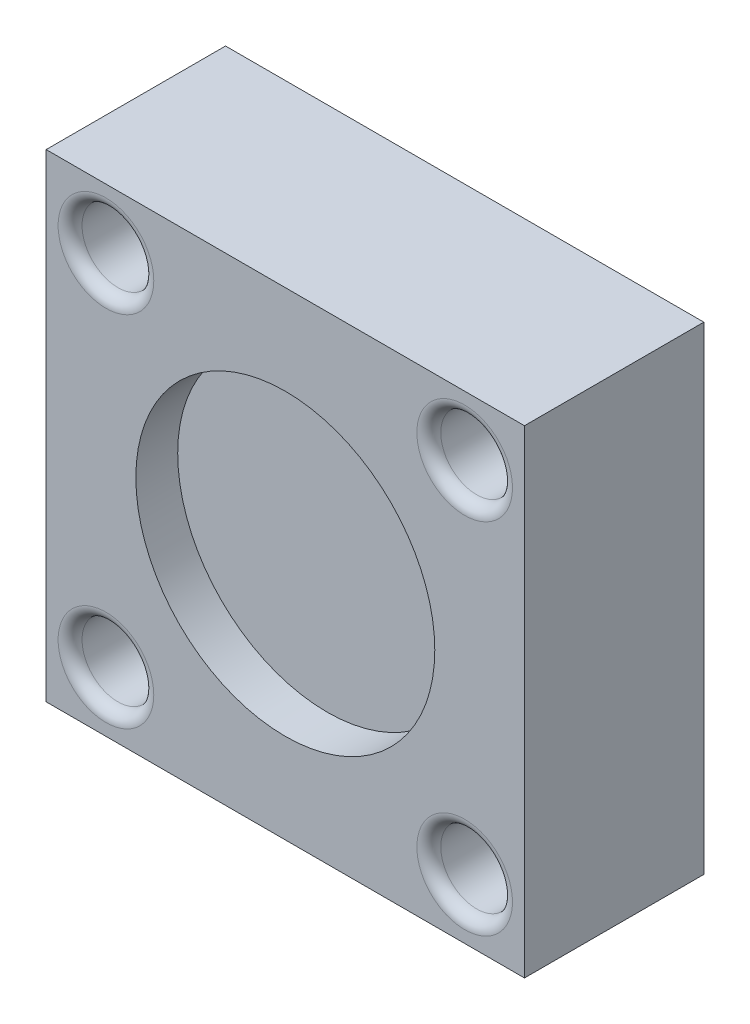
ISO-10303-21;
HEADER;
FILE_DESCRIPTION(('STEP AP214'),'2;1');
FILE_NAME('part.step','',(''),(''),'','','');
FILE_SCHEMA(('AUTOMOTIVE_DESIGN { 1 0 10303 214 1 1 1 1 }'));
ENDSEC;
DATA;
#1=APPLICATION_CONTEXT('core data for automotive mechanical design processes');
#2=APPLICATION_PROTOCOL_DEFINITION('international standard','automotive_design',2000,#1);
#3=PRODUCT_CONTEXT('',#1,'mechanical');
#4=PRODUCT('Part','Part','',(#3));
#5=PRODUCT_RELATED_PRODUCT_CATEGORY('part','',(#4));
#6=PRODUCT_DEFINITION_FORMATION('','',#4);
#7=PRODUCT_DEFINITION_CONTEXT('part definition',#1,'design');
#8=PRODUCT_DEFINITION('design','',#6,#7);
#9=PRODUCT_DEFINITION_SHAPE('','',#8);
#10=(LENGTH_UNIT() NAMED_UNIT(*) SI_UNIT(.MILLI.,.METRE.));
#11=(NAMED_UNIT(*) PLANE_ANGLE_UNIT() SI_UNIT($,.RADIAN.));
#12=(NAMED_UNIT(*) SI_UNIT($,.STERADIAN.) SOLID_ANGLE_UNIT());
#13=UNCERTAINTY_MEASURE_WITH_UNIT(LENGTH_MEASURE(1.E-05),#10,'distance_accuracy_value','');
#14=(GEOMETRIC_REPRESENTATION_CONTEXT(3) GLOBAL_UNCERTAINTY_ASSIGNED_CONTEXT((#13)) GLOBAL_UNIT_ASSIGNED_CONTEXT((#10,
#11,#12)) REPRESENTATION_CONTEXT('',''));
#15=CARTESIAN_POINT('',(0.,0.,0.));
#16=DIRECTION('',(0.,0.,1.));
#17=DIRECTION('',(1.,0.,0.));
#18=AXIS2_PLACEMENT_3D('',#15,#16,#17);
#19=CARTESIAN_POINT('',(-15.,15.,0.));
#20=DIRECTION('',(0.,0.,1.));
#21=DIRECTION('',(1.,0.,0.));
#22=AXIS2_PLACEMENT_3D('',#19,#20,#21);
#23=CYLINDRICAL_SURFACE('',#22,1.75);
#24=CARTESIAN_POINT('',(-15.,15.,0.));
#25=DIRECTION('',(0.,0.,1.));
#26=DIRECTION('',(1.,0.,0.));
#27=AXIS2_PLACEMENT_3D('',#24,#25,#26);
#28=CIRCLE('',#27,1.75);
#29=CARTESIAN_POINT('',(-13.25,15.,0.));
#30=VERTEX_POINT('',#29);
#31=EDGE_CURVE('E236',#30,#30,#28,.T.);
#32=ORIENTED_EDGE('',*,*,#31,.F.);
#33=EDGE_LOOP('',(#32));
#34=FACE_BOUND('',#33,.T.);
#35=CARTESIAN_POINT('',(-15.,15.,8.));
#36=DIRECTION('',(0.,0.,1.));
#37=DIRECTION('',(1.,0.,0.));
#38=AXIS2_PLACEMENT_3D('',#35,#36,#37);
#39=CIRCLE('',#38,1.75);
#40=CARTESIAN_POINT('',(-13.25,15.,8.));
#41=VERTEX_POINT('',#40);
#42=EDGE_CURVE('E125',#41,#41,#39,.F.);
#43=ORIENTED_EDGE('',*,*,#42,.F.);
#44=EDGE_LOOP('',(#43));
#45=FACE_BOUND('',#44,.T.);
#46=ADVANCED_FACE('F33',(#34,#45),#23,.F.);
#47=CARTESIAN_POINT('',(-15.,-15.,0.));
#48=DIRECTION('',(0.,0.,1.));
#49=DIRECTION('',(1.,0.,0.));
#50=AXIS2_PLACEMENT_3D('',#47,#48,#49);
#51=CYLINDRICAL_SURFACE('',#50,1.75);
#52=CARTESIAN_POINT('',(-15.,-15.,0.));
#53=DIRECTION('',(0.,0.,1.));
#54=DIRECTION('',(1.,0.,0.));
#55=AXIS2_PLACEMENT_3D('',#52,#53,#54);
#56=CIRCLE('',#55,1.75);
#57=CARTESIAN_POINT('',(-13.25,-15.,0.));
#58=VERTEX_POINT('',#57);
#59=EDGE_CURVE('E115',#58,#58,#56,.T.);
#60=ORIENTED_EDGE('',*,*,#59,.F.);
#61=EDGE_LOOP('',(#60));
#62=FACE_BOUND('',#61,.T.);
#63=CARTESIAN_POINT('',(-15.,-15.,8.));
#64=DIRECTION('',(0.,0.,1.));
#65=DIRECTION('',(1.,0.,0.));
#66=AXIS2_PLACEMENT_3D('',#63,#64,#65);
#67=CIRCLE('',#66,1.75);
#68=CARTESIAN_POINT('',(-13.25,-15.,8.));
#69=VERTEX_POINT('',#68);
#70=EDGE_CURVE('E121',#69,#69,#67,.F.);
#71=ORIENTED_EDGE('',*,*,#70,.F.);
#72=EDGE_LOOP('',(#71));
#73=FACE_BOUND('',#72,.T.);
#74=ADVANCED_FACE('F166',(#62,#73),#51,.F.);
#75=CARTESIAN_POINT('',(15.,-15.,0.));
#76=DIRECTION('',(0.,0.,1.));
#77=DIRECTION('',(1.,0.,0.));
#78=AXIS2_PLACEMENT_3D('',#75,#76,#77);
#79=CYLINDRICAL_SURFACE('',#78,1.75);
#80=CARTESIAN_POINT('',(15.,-15.,0.));
#81=DIRECTION('',(0.,0.,1.));
#82=DIRECTION('',(1.,0.,0.));
#83=AXIS2_PLACEMENT_3D('',#80,#81,#82);
#84=CIRCLE('',#83,1.75);
#85=CARTESIAN_POINT('',(16.75,-15.,0.));
#86=VERTEX_POINT('',#85);
#87=EDGE_CURVE('E239',#86,#86,#84,.T.);
#88=ORIENTED_EDGE('',*,*,#87,.F.);
#89=EDGE_LOOP('',(#88));
#90=FACE_BOUND('',#89,.T.);
#91=CARTESIAN_POINT('',(15.,-15.,8.));
#92=DIRECTION('',(0.,0.,1.));
#93=DIRECTION('',(1.,0.,0.));
#94=AXIS2_PLACEMENT_3D('',#91,#92,#93);
#95=CIRCLE('',#94,1.75);
#96=CARTESIAN_POINT('',(16.75,-15.,8.));
#97=VERTEX_POINT('',#96);
#98=EDGE_CURVE('E117',#97,#97,#95,.F.);
#99=ORIENTED_EDGE('',*,*,#98,.F.);
#100=EDGE_LOOP('',(#99));
#101=FACE_BOUND('',#100,.T.);
#102=ADVANCED_FACE('F172',(#90,#101),#79,.F.);
#103=CARTESIAN_POINT('',(15.,15.,0.));
#104=DIRECTION('',(0.,0.,1.));
#105=DIRECTION('',(1.,0.,0.));
#106=AXIS2_PLACEMENT_3D('',#103,#104,#105);
#107=CYLINDRICAL_SURFACE('',#106,1.75);
#108=CARTESIAN_POINT('',(15.,15.,0.));
#109=DIRECTION('',(0.,0.,1.));
#110=DIRECTION('',(1.,0.,0.));
#111=AXIS2_PLACEMENT_3D('',#108,#109,#110);
#112=CIRCLE('',#111,1.75);
#113=CARTESIAN_POINT('',(16.75,15.,0.));
#114=VERTEX_POINT('',#113);
#115=EDGE_CURVE('E104',#114,#114,#112,.T.);
#116=ORIENTED_EDGE('',*,*,#115,.F.);
#117=EDGE_LOOP('',(#116));
#118=FACE_BOUND('',#117,.T.);
#119=CARTESIAN_POINT('',(15.,15.,8.));
#120=DIRECTION('',(0.,0.,1.));
#121=DIRECTION('',(1.,0.,0.));
#122=AXIS2_PLACEMENT_3D('',#119,#120,#121);
#123=CIRCLE('',#122,1.75);
#124=CARTESIAN_POINT('',(16.75,15.,8.));
#125=VERTEX_POINT('',#124);
#126=EDGE_CURVE('E112',#125,#125,#123,.F.);
#127=ORIENTED_EDGE('',*,*,#126,.F.);
#128=EDGE_LOOP('',(#127));
#129=FACE_BOUND('',#128,.T.);
#130=ADVANCED_FACE('F181',(#118,#129),#107,.F.);
#131=CARTESIAN_POINT('',(20.,20.,15.));
#132=DIRECTION('',(-1.,0.,0.));
#133=DIRECTION('',(0.,-1.,0.));
#134=AXIS2_PLACEMENT_3D('',#131,#132,#133);
#135=PLANE('',#134);
#136=DIRECTION('',(0.,1.,0.));
#137=VECTOR('',#136,1.);
#138=CARTESIAN_POINT('',(20.,20.,0.));
#139=LINE('',#138,#137);
#140=CARTESIAN_POINT('',(20.,-20.,0.));
#141=VERTEX_POINT('',#140);
#142=CARTESIAN_POINT('',(20.,20.,0.));
#143=VERTEX_POINT('',#142);
#144=EDGE_CURVE('E101',#141,#143,#139,.T.);
#145=ORIENTED_EDGE('',*,*,#144,.T.);
#146=DIRECTION('',(0.,0.,-1.));
#147=VECTOR('',#146,1.);
#148=CARTESIAN_POINT('',(20.,20.,15.));
#149=LINE('',#148,#147);
#150=CARTESIAN_POINT('',(20.,20.,15.));
#151=VERTEX_POINT('',#150);
#152=EDGE_CURVE('E92',#151,#143,#149,.T.);
#153=ORIENTED_EDGE('',*,*,#152,.F.);
#154=DIRECTION('',(0.,1.,0.));
#155=VECTOR('',#154,1.);
#156=CARTESIAN_POINT('',(20.,20.,15.));
#157=LINE('',#156,#155);
#158=CARTESIAN_POINT('',(20.,-20.,15.));
#159=VERTEX_POINT('',#158);
#160=EDGE_CURVE('E86',#159,#151,#157,.T.);
#161=ORIENTED_EDGE('',*,*,#160,.F.);
#162=DIRECTION('',(0.,0.,-1.));
#163=VECTOR('',#162,1.);
#164=CARTESIAN_POINT('',(20.,-20.,15.));
#165=LINE('',#164,#163);
#166=EDGE_CURVE('E97',#159,#141,#165,.T.);
#167=ORIENTED_EDGE('',*,*,#166,.T.);
#168=EDGE_LOOP('',(#145,#153,#161,#167));
#169=FACE_BOUND('',#168,.T.);
#170=ADVANCED_FACE('F185',(#169),#135,.F.);
#171=CARTESIAN_POINT('',(-20.,20.,15.));
#172=DIRECTION('',(0.,-1.,0.));
#173=DIRECTION('',(0.,0.,-1.));
#174=AXIS2_PLACEMENT_3D('',#171,#172,#173);
#175=PLANE('',#174);
#176=DIRECTION('',(-1.,0.,0.));
#177=VECTOR('',#176,1.);
#178=CARTESIAN_POINT('',(-20.,20.,0.));
#179=LINE('',#178,#177);
#180=CARTESIAN_POINT('',(-20.,20.,0.));
#181=VERTEX_POINT('',#180);
#182=EDGE_CURVE('E91',#143,#181,#179,.T.);
#183=ORIENTED_EDGE('',*,*,#182,.T.);
#184=DIRECTION('',(0.,0.,-1.));
#185=VECTOR('',#184,1.);
#186=CARTESIAN_POINT('',(-20.,20.,15.));
#187=LINE('',#186,#185);
#188=CARTESIAN_POINT('',(-20.,20.,15.));
#189=VERTEX_POINT('',#188);
#190=EDGE_CURVE('E89',#189,#181,#187,.T.);
#191=ORIENTED_EDGE('',*,*,#190,.F.);
#192=DIRECTION('',(-1.,0.,0.));
#193=VECTOR('',#192,1.);
#194=CARTESIAN_POINT('',(-20.,20.,15.));
#195=LINE('',#194,#193);
#196=EDGE_CURVE('E81',#151,#189,#195,.T.);
#197=ORIENTED_EDGE('',*,*,#196,.F.);
#198=ORIENTED_EDGE('',*,*,#152,.T.);
#199=EDGE_LOOP('',(#183,#191,#197,#198));
#200=FACE_BOUND('',#199,.T.);
#201=ADVANCED_FACE('F90',(#200),#175,.F.);
#202=CARTESIAN_POINT('',(-20.,20.,15.));
#203=DIRECTION('',(1.,0.,0.));
#204=DIRECTION('',(0.,1.,0.));
#205=AXIS2_PLACEMENT_3D('',#202,#203,#204);
#206=PLANE('',#205);
#207=DIRECTION('',(0.,-1.,0.));
#208=VECTOR('',#207,1.);
#209=CARTESIAN_POINT('',(-20.,20.,0.));
#210=LINE('',#209,#208);
#211=CARTESIAN_POINT('',(-20.,-20.,0.));
#212=VERTEX_POINT('',#211);
#213=EDGE_CURVE('E67',#181,#212,#210,.T.);
#214=ORIENTED_EDGE('',*,*,#213,.T.);
#215=DIRECTION('',(0.,0.,-1.));
#216=VECTOR('',#215,1.);
#217=CARTESIAN_POINT('',(-20.,-20.,15.));
#218=LINE('',#217,#216);
#219=CARTESIAN_POINT('',(-20.,-20.,15.));
#220=VERTEX_POINT('',#219);
#221=EDGE_CURVE('E93',#220,#212,#218,.T.);
#222=ORIENTED_EDGE('',*,*,#221,.F.);
#223=DIRECTION('',(0.,-1.,0.));
#224=VECTOR('',#223,1.);
#225=CARTESIAN_POINT('',(-20.,20.,15.));
#226=LINE('',#225,#224);
#227=EDGE_CURVE('E84',#189,#220,#226,.T.);
#228=ORIENTED_EDGE('',*,*,#227,.F.);
#229=ORIENTED_EDGE('',*,*,#190,.T.);
#230=EDGE_LOOP('',(#214,#222,#228,#229));
#231=FACE_BOUND('',#230,.T.);
#232=ADVANCED_FACE('F95',(#231),#206,.F.);
#233=CARTESIAN_POINT('',(-20.,-20.,15.));
#234=DIRECTION('',(0.,1.,0.));
#235=DIRECTION('',(0.,0.,1.));
#236=AXIS2_PLACEMENT_3D('',#233,#234,#235);
#237=PLANE('',#236);
#238=DIRECTION('',(1.,0.,0.));
#239=VECTOR('',#238,1.);
#240=CARTESIAN_POINT('',(-20.,-20.,0.));
#241=LINE('',#240,#239);
#242=EDGE_CURVE('E73',#212,#141,#241,.T.);
#243=ORIENTED_EDGE('',*,*,#242,.T.);
#244=ORIENTED_EDGE('',*,*,#166,.F.);
#245=DIRECTION('',(1.,0.,0.));
#246=VECTOR('',#245,1.);
#247=CARTESIAN_POINT('',(-20.,-20.,15.));
#248=LINE('',#247,#246);
#249=EDGE_CURVE('E50',#220,#159,#248,.T.);
#250=ORIENTED_EDGE('',*,*,#249,.F.);
#251=ORIENTED_EDGE('',*,*,#221,.T.);
#252=EDGE_LOOP('',(#243,#244,#250,#251));
#253=FACE_BOUND('',#252,.T.);
#254=ADVANCED_FACE('F190',(#253),#237,.F.);
#255=CARTESIAN_POINT('',(0.,0.,15.));
#256=DIRECTION('',(0.,0.,1.));
#257=DIRECTION('',(1.,0.,0.));
#258=AXIS2_PLACEMENT_3D('',#255,#256,#257);
#259=PLANE('',#258);
#260=CARTESIAN_POINT('',(0.,0.,15.));
#261=DIRECTION('',(0.,0.,1.));
#262=DIRECTION('',(1.,0.,0.));
#263=AXIS2_PLACEMENT_3D('',#260,#261,#262);
#264=CIRCLE('',#263,12.5);
#265=CARTESIAN_POINT('',(12.5,0.,15.));
#266=VERTEX_POINT('',#265);
#267=EDGE_CURVE('E280',#266,#266,#264,.T.);
#268=ORIENTED_EDGE('',*,*,#267,.F.);
#269=EDGE_LOOP('',(#268));
#270=FACE_BOUND('',#269,.T.);
#271=CARTESIAN_POINT('',(-15.,-15.,15.));
#272=DIRECTION('',(0.,0.,1.));
#273=DIRECTION('',(1.,0.,0.));
#274=AXIS2_PLACEMENT_3D('',#271,#272,#273);
#275=CIRCLE('',#274,4.);
#276=CARTESIAN_POINT('',(-11.,-15.,15.));
#277=VERTEX_POINT('',#276);
#278=EDGE_CURVE('E140',#277,#277,#275,.F.);
#279=ORIENTED_EDGE('',*,*,#278,.T.);
#280=EDGE_LOOP('',(#279));
#281=FACE_BOUND('',#280,.T.);
#282=CARTESIAN_POINT('',(15.,-15.,15.));
#283=DIRECTION('',(0.,0.,1.));
#284=DIRECTION('',(1.,0.,0.));
#285=AXIS2_PLACEMENT_3D('',#282,#283,#284);
#286=CIRCLE('',#285,4.);
#287=CARTESIAN_POINT('',(19.,-15.,15.));
#288=VERTEX_POINT('',#287);
#289=EDGE_CURVE('E137',#288,#288,#286,.F.);
#290=ORIENTED_EDGE('',*,*,#289,.T.);
#291=EDGE_LOOP('',(#290));
#292=FACE_BOUND('',#291,.T.);
#293=CARTESIAN_POINT('',(15.,15.,15.));
#294=DIRECTION('',(0.,0.,1.));
#295=DIRECTION('',(1.,0.,0.));
#296=AXIS2_PLACEMENT_3D('',#293,#294,#295);
#297=CIRCLE('',#296,4.);
#298=CARTESIAN_POINT('',(19.,15.,15.));
#299=VERTEX_POINT('',#298);
#300=EDGE_CURVE('E134',#299,#299,#297,.F.);
#301=ORIENTED_EDGE('',*,*,#300,.T.);
#302=EDGE_LOOP('',(#301));
#303=FACE_BOUND('',#302,.T.);
#304=CARTESIAN_POINT('',(-15.,15.,15.));
#305=DIRECTION('',(0.,0.,1.));
#306=DIRECTION('',(1.,0.,0.));
#307=AXIS2_PLACEMENT_3D('',#304,#305,#306);
#308=CIRCLE('',#307,4.);
#309=CARTESIAN_POINT('',(-11.,15.,15.));
#310=VERTEX_POINT('',#309);
#311=EDGE_CURVE('E131',#310,#310,#308,.F.);
#312=ORIENTED_EDGE('',*,*,#311,.T.);
#313=EDGE_LOOP('',(#312));
#314=FACE_BOUND('',#313,.T.);
#315=ORIENTED_EDGE('',*,*,#160,.T.);
#316=ORIENTED_EDGE('',*,*,#196,.T.);
#317=ORIENTED_EDGE('',*,*,#227,.T.);
#318=ORIENTED_EDGE('',*,*,#249,.T.);
#319=EDGE_LOOP('',(#315,#316,#317,#318));
#320=FACE_BOUND('',#319,.T.);
#321=ADVANCED_FACE('F82',(#270,#281,#292,#303,#314,#320),#259,.T.);
#322=CARTESIAN_POINT('',(0.,0.,0.));
#323=DIRECTION('',(0.,0.,1.));
#324=DIRECTION('',(1.,0.,0.));
#325=AXIS2_PLACEMENT_3D('',#322,#323,#324);
#326=PLANE('',#325);
#327=ORIENTED_EDGE('',*,*,#59,.T.);
#328=EDGE_LOOP('',(#327));
#329=FACE_BOUND('',#328,.T.);
#330=ORIENTED_EDGE('',*,*,#31,.T.);
#331=EDGE_LOOP('',(#330));
#332=FACE_BOUND('',#331,.T.);
#333=ORIENTED_EDGE('',*,*,#87,.T.);
#334=EDGE_LOOP('',(#333));
#335=FACE_BOUND('',#334,.T.);
#336=ORIENTED_EDGE('',*,*,#115,.T.);
#337=EDGE_LOOP('',(#336));
#338=FACE_BOUND('',#337,.T.);
#339=ORIENTED_EDGE('',*,*,#144,.F.);
#340=ORIENTED_EDGE('',*,*,#242,.F.);
#341=ORIENTED_EDGE('',*,*,#213,.F.);
#342=ORIENTED_EDGE('',*,*,#182,.F.);
#343=EDGE_LOOP('',(#339,#340,#341,#342));
#344=FACE_BOUND('',#343,.T.);
#345=ADVANCED_FACE('F189',(#329,#332,#335,#338,#344),#326,.F.);
#346=CARTESIAN_POINT('',(15.,15.,8.));
#347=DIRECTION('',(0.,0.,1.));
#348=DIRECTION('',(1.,0.,0.));
#349=AXIS2_PLACEMENT_3D('',#346,#347,#348);
#350=PLANE('',#349);
#351=CARTESIAN_POINT('',(15.,15.,8.));
#352=DIRECTION('',(0.,0.,1.));
#353=DIRECTION('',(1.,0.,0.));
#354=AXIS2_PLACEMENT_3D('',#351,#352,#353);
#355=CIRCLE('',#354,3.);
#356=CARTESIAN_POINT('',(18.,15.,8.));
#357=VERTEX_POINT('',#356);
#358=EDGE_CURVE('E116',#357,#357,#355,.T.);
#359=ORIENTED_EDGE('',*,*,#358,.T.);
#360=EDGE_LOOP('',(#359));
#361=FACE_BOUND('',#360,.T.);
#362=ORIENTED_EDGE('',*,*,#126,.T.);
#363=EDGE_LOOP('',(#362));
#364=FACE_BOUND('',#363,.T.);
#365=ADVANCED_FACE('F194',(#361,#364),#350,.T.);
#366=CARTESIAN_POINT('',(15.,15.,8.));
#367=DIRECTION('',(0.,0.,1.));
#368=DIRECTION('',(1.,0.,0.));
#369=AXIS2_PLACEMENT_3D('',#366,#367,#368);
#370=CYLINDRICAL_SURFACE('',#369,3.);
#371=CARTESIAN_POINT('',(15.,15.,14.));
#372=DIRECTION('',(0.,0.,1.));
#373=DIRECTION('',(1.,0.,0.));
#374=AXIS2_PLACEMENT_3D('',#371,#372,#373);
#375=CIRCLE('',#374,3.);
#376=CARTESIAN_POINT('',(18.,15.,14.));
#377=VERTEX_POINT('',#376);
#378=EDGE_CURVE('E42',#377,#377,#375,.T.);
#379=ORIENTED_EDGE('',*,*,#378,.T.);
#380=EDGE_LOOP('',(#379));
#381=FACE_BOUND('',#380,.T.);
#382=ORIENTED_EDGE('',*,*,#358,.F.);
#383=EDGE_LOOP('',(#382));
#384=FACE_BOUND('',#383,.T.);
#385=ADVANCED_FACE('F148',(#381,#384),#370,.F.);
#386=CARTESIAN_POINT('',(15.,-15.,8.));
#387=DIRECTION('',(0.,0.,1.));
#388=DIRECTION('',(1.,0.,0.));
#389=AXIS2_PLACEMENT_3D('',#386,#387,#388);
#390=PLANE('',#389);
#391=CARTESIAN_POINT('',(15.,-15.,8.));
#392=DIRECTION('',(0.,0.,1.));
#393=DIRECTION('',(1.,0.,0.));
#394=AXIS2_PLACEMENT_3D('',#391,#392,#393);
#395=CIRCLE('',#394,3.);
#396=CARTESIAN_POINT('',(18.,-15.,8.));
#397=VERTEX_POINT('',#396);
#398=EDGE_CURVE('E120',#397,#397,#395,.T.);
#399=ORIENTED_EDGE('',*,*,#398,.T.);
#400=EDGE_LOOP('',(#399));
#401=FACE_BOUND('',#400,.T.);
#402=ORIENTED_EDGE('',*,*,#98,.T.);
#403=EDGE_LOOP('',(#402));
#404=FACE_BOUND('',#403,.T.);
#405=ADVANCED_FACE('F255',(#401,#404),#390,.T.);
#406=CARTESIAN_POINT('',(15.,-15.,8.));
#407=DIRECTION('',(0.,0.,1.));
#408=DIRECTION('',(1.,0.,0.));
#409=AXIS2_PLACEMENT_3D('',#406,#407,#408);
#410=CYLINDRICAL_SURFACE('',#409,3.);
#411=CARTESIAN_POINT('',(15.,-15.,14.));
#412=DIRECTION('',(0.,0.,1.));
#413=DIRECTION('',(1.,0.,0.));
#414=AXIS2_PLACEMENT_3D('',#411,#412,#413);
#415=CIRCLE('',#414,3.);
#416=CARTESIAN_POINT('',(18.,-15.,14.));
#417=VERTEX_POINT('',#416);
#418=EDGE_CURVE('E143',#417,#417,#415,.T.);
#419=ORIENTED_EDGE('',*,*,#418,.T.);
#420=EDGE_LOOP('',(#419));
#421=FACE_BOUND('',#420,.T.);
#422=ORIENTED_EDGE('',*,*,#398,.F.);
#423=EDGE_LOOP('',(#422));
#424=FACE_BOUND('',#423,.T.);
#425=ADVANCED_FACE('F257',(#421,#424),#410,.F.);
#426=CARTESIAN_POINT('',(-15.,-15.,8.));
#427=DIRECTION('',(0.,0.,1.));
#428=DIRECTION('',(1.,0.,0.));
#429=AXIS2_PLACEMENT_3D('',#426,#427,#428);
#430=PLANE('',#429);
#431=CARTESIAN_POINT('',(-15.,-15.,8.));
#432=DIRECTION('',(0.,0.,1.));
#433=DIRECTION('',(1.,0.,0.));
#434=AXIS2_PLACEMENT_3D('',#431,#432,#433);
#435=CIRCLE('',#434,3.);
#436=CARTESIAN_POINT('',(-12.,-15.,8.));
#437=VERTEX_POINT('',#436);
#438=EDGE_CURVE('E124',#437,#437,#435,.T.);
#439=ORIENTED_EDGE('',*,*,#438,.T.);
#440=EDGE_LOOP('',(#439));
#441=FACE_BOUND('',#440,.T.);
#442=ORIENTED_EDGE('',*,*,#70,.T.);
#443=EDGE_LOOP('',(#442));
#444=FACE_BOUND('',#443,.T.);
#445=ADVANCED_FACE('F221',(#441,#444),#430,.T.);
#446=CARTESIAN_POINT('',(-15.,-15.,8.));
#447=DIRECTION('',(0.,0.,1.));
#448=DIRECTION('',(1.,0.,0.));
#449=AXIS2_PLACEMENT_3D('',#446,#447,#448);
#450=CYLINDRICAL_SURFACE('',#449,3.);
#451=CARTESIAN_POINT('',(-15.,-15.,14.));
#452=DIRECTION('',(0.,0.,1.));
#453=DIRECTION('',(1.,0.,0.));
#454=AXIS2_PLACEMENT_3D('',#451,#452,#453);
#455=CIRCLE('',#454,3.);
#456=CARTESIAN_POINT('',(-12.,-15.,14.));
#457=VERTEX_POINT('',#456);
#458=EDGE_CURVE('E111',#457,#457,#455,.T.);
#459=ORIENTED_EDGE('',*,*,#458,.T.);
#460=EDGE_LOOP('',(#459));
#461=FACE_BOUND('',#460,.T.);
#462=ORIENTED_EDGE('',*,*,#438,.F.);
#463=EDGE_LOOP('',(#462));
#464=FACE_BOUND('',#463,.T.);
#465=ADVANCED_FACE('F218',(#461,#464),#450,.F.);
#466=CARTESIAN_POINT('',(-15.,15.,8.));
#467=DIRECTION('',(0.,0.,1.));
#468=DIRECTION('',(1.,0.,0.));
#469=AXIS2_PLACEMENT_3D('',#466,#467,#468);
#470=PLANE('',#469);
#471=CARTESIAN_POINT('',(-15.,15.,8.));
#472=DIRECTION('',(0.,0.,1.));
#473=DIRECTION('',(1.,0.,0.));
#474=AXIS2_PLACEMENT_3D('',#471,#472,#473);
#475=CIRCLE('',#474,3.);
#476=CARTESIAN_POINT('',(-12.,15.,8.));
#477=VERTEX_POINT('',#476);
#478=EDGE_CURVE('E128',#477,#477,#475,.T.);
#479=ORIENTED_EDGE('',*,*,#478,.T.);
#480=EDGE_LOOP('',(#479));
#481=FACE_BOUND('',#480,.T.);
#482=ORIENTED_EDGE('',*,*,#42,.T.);
#483=EDGE_LOOP('',(#482));
#484=FACE_BOUND('',#483,.T.);
#485=ADVANCED_FACE('F211',(#481,#484),#470,.T.);
#486=CARTESIAN_POINT('',(-15.,15.,8.));
#487=DIRECTION('',(0.,0.,1.));
#488=DIRECTION('',(1.,0.,0.));
#489=AXIS2_PLACEMENT_3D('',#486,#487,#488);
#490=CYLINDRICAL_SURFACE('',#489,3.);
#491=CARTESIAN_POINT('',(-15.,15.,14.));
#492=DIRECTION('',(0.,0.,1.));
#493=DIRECTION('',(1.,0.,0.));
#494=AXIS2_PLACEMENT_3D('',#491,#492,#493);
#495=CIRCLE('',#494,3.);
#496=CARTESIAN_POINT('',(-12.,15.,14.));
#497=VERTEX_POINT('',#496);
#498=EDGE_CURVE('E11',#497,#497,#495,.T.);
#499=ORIENTED_EDGE('',*,*,#498,.T.);
#500=EDGE_LOOP('',(#499));
#501=FACE_BOUND('',#500,.T.);
#502=ORIENTED_EDGE('',*,*,#478,.F.);
#503=EDGE_LOOP('',(#502));
#504=FACE_BOUND('',#503,.T.);
#505=ADVANCED_FACE('F206',(#501,#504),#490,.F.);
#506=CARTESIAN_POINT('',(-15.,-15.,14.));
#507=DIRECTION('',(0.,0.,1.));
#508=DIRECTION('',(1.,0.,0.));
#509=AXIS2_PLACEMENT_3D('',#506,#507,#508);
#510=TOROIDAL_SURFACE('',#509,4.,1.);
#511=ORIENTED_EDGE('',*,*,#278,.F.);
#512=EDGE_LOOP('',(#511));
#513=FACE_BOUND('',#512,.T.);
#514=ORIENTED_EDGE('',*,*,#458,.F.);
#515=EDGE_LOOP('',(#514));
#516=FACE_BOUND('',#515,.T.);
#517=ADVANCED_FACE('F161',(#513,#516),#510,.T.);
#518=CARTESIAN_POINT('',(15.,-15.,14.));
#519=DIRECTION('',(0.,0.,1.));
#520=DIRECTION('',(1.,0.,0.));
#521=AXIS2_PLACEMENT_3D('',#518,#519,#520);
#522=TOROIDAL_SURFACE('',#521,4.,1.);
#523=ORIENTED_EDGE('',*,*,#289,.F.);
#524=EDGE_LOOP('',(#523));
#525=FACE_BOUND('',#524,.T.);
#526=ORIENTED_EDGE('',*,*,#418,.F.);
#527=EDGE_LOOP('',(#526));
#528=FACE_BOUND('',#527,.T.);
#529=ADVANCED_FACE('F153',(#525,#528),#522,.T.);
#530=CARTESIAN_POINT('',(15.,15.,14.));
#531=DIRECTION('',(0.,0.,1.));
#532=DIRECTION('',(1.,0.,0.));
#533=AXIS2_PLACEMENT_3D('',#530,#531,#532);
#534=TOROIDAL_SURFACE('',#533,4.,1.);
#535=ORIENTED_EDGE('',*,*,#300,.F.);
#536=EDGE_LOOP('',(#535));
#537=FACE_BOUND('',#536,.T.);
#538=ORIENTED_EDGE('',*,*,#378,.F.);
#539=EDGE_LOOP('',(#538));
#540=FACE_BOUND('',#539,.T.);
#541=ADVANCED_FACE('F151',(#537,#540),#534,.T.);
#542=CARTESIAN_POINT('',(-15.,15.,14.));
#543=DIRECTION('',(0.,0.,1.));
#544=DIRECTION('',(1.,0.,0.));
#545=AXIS2_PLACEMENT_3D('',#542,#543,#544);
#546=TOROIDAL_SURFACE('',#545,4.,1.);
#547=ORIENTED_EDGE('',*,*,#311,.F.);
#548=EDGE_LOOP('',(#547));
#549=FACE_BOUND('',#548,.T.);
#550=ORIENTED_EDGE('',*,*,#498,.F.);
#551=EDGE_LOOP('',(#550));
#552=FACE_BOUND('',#551,.T.);
#553=ADVANCED_FACE('F35',(#549,#552),#546,.T.);
#554=CARTESIAN_POINT('',(0.,0.,11.5));
#555=DIRECTION('',(0.,0.,1.));
#556=DIRECTION('',(1.,0.,0.));
#557=AXIS2_PLACEMENT_3D('',#554,#555,#556);
#558=CYLINDRICAL_SURFACE('',#557,12.5);
#559=CARTESIAN_POINT('',(0.,0.,11.5));
#560=DIRECTION('',(0.,0.,1.));
#561=DIRECTION('',(1.,0.,0.));
#562=AXIS2_PLACEMENT_3D('',#559,#560,#561);
#563=CIRCLE('',#562,12.5);
#564=CARTESIAN_POINT('',(12.5,0.,11.5));
#565=VERTEX_POINT('',#564);
#566=EDGE_CURVE('E279',#565,#565,#563,.T.);
#567=ORIENTED_EDGE('',*,*,#566,.F.);
#568=EDGE_LOOP('',(#567));
#569=FACE_BOUND('',#568,.T.);
#570=ORIENTED_EDGE('',*,*,#267,.T.);
#571=EDGE_LOOP('',(#570));
#572=FACE_BOUND('',#571,.T.);
#573=ADVANCED_FACE('F159',(#569,#572),#558,.F.);
#574=CARTESIAN_POINT('',(0.,0.,11.5));
#575=DIRECTION('',(0.,0.,1.));
#576=DIRECTION('',(1.,0.,0.));
#577=AXIS2_PLACEMENT_3D('',#574,#575,#576);
#578=PLANE('',#577);
#579=ORIENTED_EDGE('',*,*,#566,.T.);
#580=EDGE_LOOP('',(#579));
#581=FACE_BOUND('',#580,.T.);
#582=ADVANCED_FACE('F271',(#581),#578,.T.);
#583=CLOSED_SHELL('',(#46,#74,#102,#130,#170,#201,#232,#254,#321,#345,#365,#385,#405,#425,#445,
#465,#485,#505,#517,#529,#541,#553,#573,#582));
#584=MANIFOLD_SOLID_BREP('B2',#583);
#585=ADVANCED_BREP_SHAPE_REPRESENTATION('',(#18,#584),#14);
#586=SHAPE_DEFINITION_REPRESENTATION(#9,#585);
ENDSEC;
END-ISO-10303-21;
